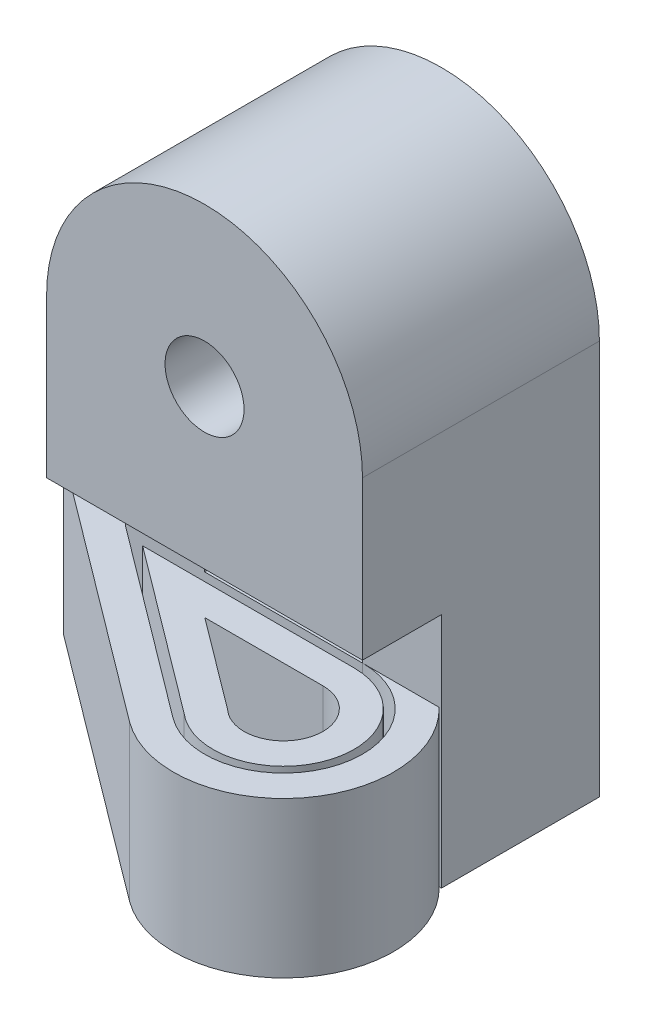
ISO-10303-21;
HEADER;
FILE_DESCRIPTION(('STEP AP214'),'2;1');
FILE_NAME('part.step','',(''),(''),'','','');
FILE_SCHEMA(('AUTOMOTIVE_DESIGN { 1 0 10303 214 1 1 1 1 }'));
ENDSEC;
DATA;
#1=APPLICATION_CONTEXT('core data for automotive mechanical design processes');
#2=APPLICATION_PROTOCOL_DEFINITION('international standard','automotive_design',2000,#1);
#3=PRODUCT_CONTEXT('',#1,'mechanical');
#4=PRODUCT('Part','Part','',(#3));
#5=PRODUCT_RELATED_PRODUCT_CATEGORY('part','',(#4));
#6=PRODUCT_DEFINITION_FORMATION('','',#4);
#7=PRODUCT_DEFINITION_CONTEXT('part definition',#1,'design');
#8=PRODUCT_DEFINITION('design','',#6,#7);
#9=PRODUCT_DEFINITION_SHAPE('','',#8);
#10=(LENGTH_UNIT() NAMED_UNIT(*) SI_UNIT(.MILLI.,.METRE.));
#11=(NAMED_UNIT(*) PLANE_ANGLE_UNIT() SI_UNIT($,.RADIAN.));
#12=(NAMED_UNIT(*) SI_UNIT($,.STERADIAN.) SOLID_ANGLE_UNIT());
#13=UNCERTAINTY_MEASURE_WITH_UNIT(LENGTH_MEASURE(1.E-05),#10,'distance_accuracy_value','');
#14=(GEOMETRIC_REPRESENTATION_CONTEXT(3) GLOBAL_UNCERTAINTY_ASSIGNED_CONTEXT((#13)) GLOBAL_UNIT_ASSIGNED_CONTEXT((#10,
#11,#12)) REPRESENTATION_CONTEXT('',''));
#15=CARTESIAN_POINT('',(0.,0.,0.));
#16=DIRECTION('',(0.,0.,1.));
#17=DIRECTION('',(1.,0.,0.));
#18=AXIS2_PLACEMENT_3D('',#15,#16,#17);
#19=CARTESIAN_POINT('',(76.2,50.,76.2));
#20=DIRECTION('',(0.,-1.,0.));
#21=DIRECTION('',(1.,0.,0.));
#22=AXIS2_PLACEMENT_3D('',#19,#20,#21);
#23=PLANE('',#22);
#24=DIRECTION('',(-1.,0.,0.));
#25=VECTOR('',#24,1.);
#26=CARTESIAN_POINT('',(0.,50.,53.5));
#27=LINE('',#26,#25);
#28=CARTESIAN_POINT('',(76.2,50.,53.5));
#29=VERTEX_POINT('',#28);
#30=CARTESIAN_POINT('',(8.19548632092121,50.,53.5));
#31=VERTEX_POINT('',#30);
#32=EDGE_CURVE('E262',#29,#31,#27,.T.);
#33=ORIENTED_EDGE('',*,*,#32,.T.);
#34=DIRECTION('',(0.8,0.,0.6));
#35=VECTOR('',#34,1.);
#36=CARTESIAN_POINT('',(-22.7296249244684,50.,30.3061665659578));
#37=LINE('',#36,#35);
#38=CARTESIAN_POINT('',(61.3249683822276,50.,93.3471115459798));
#39=VERTEX_POINT('',#38);
#40=EDGE_CURVE('E265',#31,#39,#37,.T.);
#41=ORIENTED_EDGE('',*,*,#40,.T.);
#42=CARTESIAN_POINT('',(76.2,50.,76.2));
#43=DIRECTION('',(0.,-1.,0.));
#44=DIRECTION('',(0.,0.,-1.));
#45=AXIS2_PLACEMENT_3D('',#42,#43,#44);
#46=CIRCLE('',#45,22.7);
#47=EDGE_CURVE('E268',#29,#39,#46,.T.);
#48=ORIENTED_EDGE('',*,*,#47,.F.);
#49=EDGE_LOOP('',(#33,#41,#48));
#50=FACE_BOUND('',#49,.T.);
#51=DIRECTION('',(-1.,0.,0.));
#52=VECTOR('',#51,1.);
#53=CARTESIAN_POINT('',(0.,50.,63.5));
#54=LINE('',#53,#52);
#55=CARTESIAN_POINT('',(76.2,50.,63.5));
#56=VERTEX_POINT('',#55);
#57=CARTESIAN_POINT('',(38.1954863209212,50.,63.5));
#58=VERTEX_POINT('',#57);
#59=EDGE_CURVE('E236',#56,#58,#54,.T.);
#60=ORIENTED_EDGE('',*,*,#59,.F.);
#61=CARTESIAN_POINT('',(76.2,50.,76.2));
#62=DIRECTION('',(0.,-1.,0.));
#63=DIRECTION('',(1.,0.,0.));
#64=AXIS2_PLACEMENT_3D('',#61,#62,#63);
#65=CIRCLE('',#64,12.7);
#66=CARTESIAN_POINT('',(67.6504068830784,50.,85.5911904216179));
#67=VERTEX_POINT('',#66);
#68=EDGE_CURVE('E253',#56,#67,#65,.T.);
#69=ORIENTED_EDGE('',*,*,#68,.T.);
#70=DIRECTION('',(0.8,0.,0.6));
#71=VECTOR('',#70,1.);
#72=CARTESIAN_POINT('',(-16.7296249244684,50.,22.3061665659578));
#73=LINE('',#72,#71);
#74=EDGE_CURVE('E244',#58,#67,#73,.T.);
#75=ORIENTED_EDGE('',*,*,#74,.F.);
#76=EDGE_LOOP('',(#60,#69,#75));
#77=FACE_BOUND('',#76,.T.);
#78=ADVANCED_FACE('F183',(#50,#77),#23,.F.);
#79=CARTESIAN_POINT('',(76.2,0.,76.2));
#80=DIRECTION('',(0.,-1.,0.));
#81=DIRECTION('',(1.,0.,0.));
#82=AXIS2_PLACEMENT_3D('',#79,#80,#81);
#83=PLANE('',#82);
#84=DIRECTION('',(-1.,0.,0.));
#85=VECTOR('',#84,1.);
#86=CARTESIAN_POINT('',(0.,0.,53.5));
#87=LINE('',#86,#85);
#88=CARTESIAN_POINT('',(76.2,0.,53.5));
#89=VERTEX_POINT('',#88);
#90=CARTESIAN_POINT('',(8.19548632092122,0.,53.5));
#91=VERTEX_POINT('',#90);
#92=EDGE_CURVE('E251',#89,#91,#87,.T.);
#93=ORIENTED_EDGE('',*,*,#92,.F.);
#94=CARTESIAN_POINT('',(76.2,0.,76.2));
#95=DIRECTION('',(0.,-1.,0.));
#96=DIRECTION('',(0.,0.,-1.));
#97=AXIS2_PLACEMENT_3D('',#94,#95,#96);
#98=CIRCLE('',#97,22.7);
#99=CARTESIAN_POINT('',(61.3249683822276,0.,93.3471115459798));
#100=VERTEX_POINT('',#99);
#101=EDGE_CURVE('E266',#89,#100,#98,.T.);
#102=ORIENTED_EDGE('',*,*,#101,.T.);
#103=DIRECTION('',(0.8,0.,0.6));
#104=VECTOR('',#103,1.);
#105=CARTESIAN_POINT('',(-22.7296249244684,0.,30.3061665659578));
#106=LINE('',#105,#104);
#107=EDGE_CURVE('E274',#91,#100,#106,.T.);
#108=ORIENTED_EDGE('',*,*,#107,.F.);
#109=EDGE_LOOP('',(#93,#102,#108));
#110=FACE_BOUND('',#109,.T.);
#111=CARTESIAN_POINT('',(76.2,0.,76.2));
#112=DIRECTION('',(0.,-1.,0.));
#113=DIRECTION('',(1.,0.,0.));
#114=AXIS2_PLACEMENT_3D('',#111,#112,#113);
#115=CIRCLE('',#114,12.7);
#116=CARTESIAN_POINT('',(76.2,0.,63.5));
#117=VERTEX_POINT('',#116);
#118=CARTESIAN_POINT('',(67.6504068830784,0.,85.5911904216179));
#119=VERTEX_POINT('',#118);
#120=EDGE_CURVE('E245',#117,#119,#115,.T.);
#121=ORIENTED_EDGE('',*,*,#120,.F.);
#122=DIRECTION('',(-1.,0.,0.));
#123=VECTOR('',#122,1.);
#124=CARTESIAN_POINT('',(0.,0.,63.5));
#125=LINE('',#124,#123);
#126=CARTESIAN_POINT('',(38.1954863209212,0.,63.5));
#127=VERTEX_POINT('',#126);
#128=EDGE_CURVE('E206',#117,#127,#125,.T.);
#129=ORIENTED_EDGE('',*,*,#128,.T.);
#130=DIRECTION('',(0.8,0.,0.6));
#131=VECTOR('',#130,1.);
#132=CARTESIAN_POINT('',(-16.7296249244684,0.,22.3061665659578));
#133=LINE('',#132,#131);
#134=EDGE_CURVE('E250',#127,#119,#133,.T.);
#135=ORIENTED_EDGE('',*,*,#134,.T.);
#136=EDGE_LOOP('',(#121,#129,#135));
#137=FACE_BOUND('',#136,.T.);
#138=ADVANCED_FACE('F289',(#110,#137),#83,.T.);
#139=CARTESIAN_POINT('',(0.,50.,53.5));
#140=DIRECTION('',(0.,0.,1.));
#141=DIRECTION('',(1.,0.,0.));
#142=AXIS2_PLACEMENT_3D('',#139,#140,#141);
#143=PLANE('',#142);
#144=ORIENTED_EDGE('',*,*,#92,.T.);
#145=DIRECTION('',(0.,-1.,0.));
#146=VECTOR('',#145,1.);
#147=CARTESIAN_POINT('',(8.19548632092121,50.,53.5));
#148=LINE('',#147,#146);
#149=EDGE_CURVE('E13',#31,#91,#148,.T.);
#150=ORIENTED_EDGE('',*,*,#149,.F.);
#151=ORIENTED_EDGE('',*,*,#32,.F.);
#152=DIRECTION('',(0.,-1.,0.));
#153=VECTOR('',#152,1.);
#154=CARTESIAN_POINT('',(76.2,50.,53.5));
#155=LINE('',#154,#153);
#156=EDGE_CURVE('E271',#29,#89,#155,.T.);
#157=ORIENTED_EDGE('',*,*,#156,.T.);
#158=EDGE_LOOP('',(#144,#150,#151,#157));
#159=FACE_BOUND('',#158,.T.);
#160=ADVANCED_FACE('F185',(#159),#143,.F.);
#161=CARTESIAN_POINT('',(-22.7296249244684,50.,30.3061665659578));
#162=DIRECTION('',(0.6,0.,-0.8));
#163=DIRECTION('',(-0.8,0.,-0.6));
#164=AXIS2_PLACEMENT_3D('',#161,#162,#163);
#165=PLANE('',#164);
#166=ORIENTED_EDGE('',*,*,#107,.T.);
#167=DIRECTION('',(0.,-1.,0.));
#168=VECTOR('',#167,1.);
#169=CARTESIAN_POINT('',(61.3249683822276,50.,93.3471115459798));
#170=LINE('',#169,#168);
#171=EDGE_CURVE('E191',#39,#100,#170,.T.);
#172=ORIENTED_EDGE('',*,*,#171,.F.);
#173=ORIENTED_EDGE('',*,*,#40,.F.);
#174=ORIENTED_EDGE('',*,*,#149,.T.);
#175=EDGE_LOOP('',(#166,#172,#173,#174));
#176=FACE_BOUND('',#175,.T.);
#177=ADVANCED_FACE('F285',(#176),#165,.F.);
#178=CARTESIAN_POINT('',(76.2,50.,76.2));
#179=DIRECTION('',(0.,-1.,0.));
#180=DIRECTION('',(1.,0.,0.));
#181=AXIS2_PLACEMENT_3D('',#178,#179,#180);
#182=CYLINDRICAL_SURFACE('',#181,22.7);
#183=ORIENTED_EDGE('',*,*,#101,.F.);
#184=ORIENTED_EDGE('',*,*,#156,.F.);
#185=ORIENTED_EDGE('',*,*,#47,.T.);
#186=ORIENTED_EDGE('',*,*,#171,.T.);
#187=EDGE_LOOP('',(#183,#184,#185,#186));
#188=FACE_BOUND('',#187,.T.);
#189=ADVANCED_FACE('F282',(#188),#182,.T.);
#190=CARTESIAN_POINT('',(0.,50.,63.5));
#191=DIRECTION('',(0.,0.,1.));
#192=DIRECTION('',(1.,0.,0.));
#193=AXIS2_PLACEMENT_3D('',#190,#191,#192);
#194=PLANE('',#193);
#195=ORIENTED_EDGE('',*,*,#128,.F.);
#196=DIRECTION('',(0.,-1.,0.));
#197=VECTOR('',#196,1.);
#198=CARTESIAN_POINT('',(76.2,50.,63.5));
#199=LINE('',#198,#197);
#200=EDGE_CURVE('E240',#56,#117,#199,.T.);
#201=ORIENTED_EDGE('',*,*,#200,.F.);
#202=ORIENTED_EDGE('',*,*,#59,.T.);
#203=DIRECTION('',(0.,-1.,0.));
#204=VECTOR('',#203,1.);
#205=CARTESIAN_POINT('',(38.1954863209212,50.,63.5));
#206=LINE('',#205,#204);
#207=EDGE_CURVE('E239',#58,#127,#206,.T.);
#208=ORIENTED_EDGE('',*,*,#207,.T.);
#209=EDGE_LOOP('',(#195,#201,#202,#208));
#210=FACE_BOUND('',#209,.T.);
#211=ADVANCED_FACE('F238',(#210),#194,.T.);
#212=CARTESIAN_POINT('',(-16.7296249244684,50.,22.3061665659578));
#213=DIRECTION('',(0.6,0.,-0.8));
#214=DIRECTION('',(-0.8,0.,-0.6));
#215=AXIS2_PLACEMENT_3D('',#212,#213,#214);
#216=PLANE('',#215);
#217=ORIENTED_EDGE('',*,*,#134,.F.);
#218=ORIENTED_EDGE('',*,*,#207,.F.);
#219=ORIENTED_EDGE('',*,*,#74,.T.);
#220=DIRECTION('',(0.,-1.,0.));
#221=VECTOR('',#220,1.);
#222=CARTESIAN_POINT('',(67.6504068830784,50.,85.5911904216179));
#223=LINE('',#222,#221);
#224=EDGE_CURVE('E198',#67,#119,#223,.T.);
#225=ORIENTED_EDGE('',*,*,#224,.T.);
#226=EDGE_LOOP('',(#217,#218,#219,#225));
#227=FACE_BOUND('',#226,.T.);
#228=ADVANCED_FACE('F248',(#227),#216,.T.);
#229=CARTESIAN_POINT('',(76.2,50.,76.2));
#230=DIRECTION('',(0.,-1.,0.));
#231=DIRECTION('',(1.,0.,0.));
#232=AXIS2_PLACEMENT_3D('',#229,#230,#231);
#233=CYLINDRICAL_SURFACE('',#232,12.7);
#234=ORIENTED_EDGE('',*,*,#120,.T.);
#235=ORIENTED_EDGE('',*,*,#224,.F.);
#236=ORIENTED_EDGE('',*,*,#68,.F.);
#237=ORIENTED_EDGE('',*,*,#200,.T.);
#238=EDGE_LOOP('',(#234,#235,#236,#237));
#239=FACE_BOUND('',#238,.T.);
#240=ADVANCED_FACE('F344',(#239),#233,.F.);
#241=CLOSED_SHELL('',(#78,#138,#160,#177,#189,#211,#228,#240));
#242=MANIFOLD_SOLID_BREP('B2',#241);
#243=CARTESIAN_POINT('',(0.,0.,50.8));
#244=DIRECTION('',(-1.,0.,0.));
#245=DIRECTION('',(0.,0.,1.));
#246=AXIS2_PLACEMENT_3D('',#243,#244,#245);
#247=PLANE('',#246);
#248=DIRECTION('',(0.,1.,0.));
#249=VECTOR('',#248,1.);
#250=CARTESIAN_POINT('',(0.,0.,40.8));
#251=LINE('',#250,#249);
#252=CARTESIAN_POINT('',(0.,0.,40.8));
#253=VERTEX_POINT('',#252);
#254=CARTESIAN_POINT('',(0.,50.,40.8));
#255=VERTEX_POINT('',#254);
#256=EDGE_CURVE('E377',#253,#255,#251,.T.);
#257=ORIENTED_EDGE('',*,*,#256,.T.);
#258=DIRECTION('',(0.,0.,1.));
#259=VECTOR('',#258,1.);
#260=CARTESIAN_POINT('',(0.,50.,50.8));
#261=LINE('',#260,#259);
#262=CARTESIAN_POINT('',(0.,50.,50.8));
#263=VERTEX_POINT('',#262);
#264=EDGE_CURVE('E497',#255,#263,#261,.T.);
#265=ORIENTED_EDGE('',*,*,#264,.T.);
#266=DIRECTION('',(0.,1.,0.));
#267=VECTOR('',#266,1.);
#268=CARTESIAN_POINT('',(0.,0.,50.8));
#269=LINE('',#268,#267);
#270=CARTESIAN_POINT('',(0.,76.2,50.8));
#271=VERTEX_POINT('',#270);
#272=EDGE_CURVE('E485',#263,#271,#269,.T.);
#273=ORIENTED_EDGE('',*,*,#272,.T.);
#274=DIRECTION('',(0.,0.,-1.));
#275=VECTOR('',#274,1.);
#276=CARTESIAN_POINT('',(0.,76.2,76.2));
#277=LINE('',#276,#275);
#278=CARTESIAN_POINT('',(0.,76.2,76.2));
#279=VERTEX_POINT('',#278);
#280=EDGE_CURVE('E612',#279,#271,#277,.T.);
#281=ORIENTED_EDGE('',*,*,#280,.F.);
#282=DIRECTION('',(0.,-1.,0.));
#283=VECTOR('',#282,1.);
#284=CARTESIAN_POINT('',(0.,127.,76.2));
#285=LINE('',#284,#283);
#286=CARTESIAN_POINT('',(0.,127.,76.2));
#287=VERTEX_POINT('',#286);
#288=EDGE_CURVE('E596',#287,#279,#285,.T.);
#289=ORIENTED_EDGE('',*,*,#288,.F.);
#290=DIRECTION('',(0.,0.,-1.));
#291=VECTOR('',#290,1.);
#292=CARTESIAN_POINT('',(0.,127.,50.8));
#293=LINE('',#292,#291);
#294=CARTESIAN_POINT('',(0.,127.,0.));
#295=VERTEX_POINT('',#294);
#296=EDGE_CURVE('E677',#287,#295,#293,.T.);
#297=ORIENTED_EDGE('',*,*,#296,.T.);
#298=DIRECTION('',(0.,1.,0.));
#299=VECTOR('',#298,1.);
#300=CARTESIAN_POINT('',(0.,0.,0.));
#301=LINE('',#300,#299);
#302=CARTESIAN_POINT('',(0.,0.,0.));
#303=VERTEX_POINT('',#302);
#304=EDGE_CURVE('E639',#303,#295,#301,.T.);
#305=ORIENTED_EDGE('',*,*,#304,.F.);
#306=DIRECTION('',(0.,0.,-1.));
#307=VECTOR('',#306,1.);
#308=CARTESIAN_POINT('',(0.,0.,50.8));
#309=LINE('',#308,#307);
#310=EDGE_CURVE('E382',#253,#303,#309,.T.);
#311=ORIENTED_EDGE('',*,*,#310,.F.);
#312=EDGE_LOOP('',(#257,#265,#273,#281,#289,#297,#305,#311));
#313=FACE_BOUND('',#312,.T.);
#314=ADVANCED_FACE('F361',(#313),#247,.T.);
#315=CARTESIAN_POINT('',(25.4,0.,50.8));
#316=DIRECTION('',(-1.,0.,0.));
#317=DIRECTION('',(0.,-1.,0.));
#318=AXIS2_PLACEMENT_3D('',#315,#316,#317);
#319=PLANE('',#318);
#320=DIRECTION('',(0.,0.,1.));
#321=VECTOR('',#320,1.);
#322=CARTESIAN_POINT('',(25.4,50.,50.8));
#323=LINE('',#322,#321);
#324=CARTESIAN_POINT('',(25.4,50.,40.8));
#325=VERTEX_POINT('',#324);
#326=CARTESIAN_POINT('',(25.4,50.,50.8));
#327=VERTEX_POINT('',#326);
#328=EDGE_CURVE('E503',#325,#327,#323,.T.);
#329=ORIENTED_EDGE('',*,*,#328,.F.);
#330=DIRECTION('',(0.,1.,0.));
#331=VECTOR('',#330,1.);
#332=CARTESIAN_POINT('',(25.4,0.,40.8));
#333=LINE('',#332,#331);
#334=CARTESIAN_POINT('',(25.4,0.,40.8));
#335=VERTEX_POINT('',#334);
#336=EDGE_CURVE('E502',#335,#325,#333,.T.);
#337=ORIENTED_EDGE('',*,*,#336,.F.);
#338=DIRECTION('',(0.,0.,-1.));
#339=VECTOR('',#338,1.);
#340=CARTESIAN_POINT('',(25.4,0.,50.8));
#341=LINE('',#340,#339);
#342=CARTESIAN_POINT('',(25.4,0.,0.));
#343=VERTEX_POINT('',#342);
#344=EDGE_CURVE('E672',#335,#343,#341,.T.);
#345=ORIENTED_EDGE('',*,*,#344,.T.);
#346=DIRECTION('',(0.,1.,0.));
#347=VECTOR('',#346,1.);
#348=CARTESIAN_POINT('',(25.4,0.,0.));
#349=LINE('',#348,#347);
#350=CARTESIAN_POINT('',(25.4,50.8,0.));
#351=VERTEX_POINT('',#350);
#352=EDGE_CURVE('E647',#343,#351,#349,.T.);
#353=ORIENTED_EDGE('',*,*,#352,.T.);
#354=DIRECTION('',(0.,0.,-1.));
#355=VECTOR('',#354,1.);
#356=CARTESIAN_POINT('',(25.4,50.8,50.8));
#357=LINE('',#356,#355);
#358=CARTESIAN_POINT('',(25.4,50.8,50.8));
#359=VERTEX_POINT('',#358);
#360=EDGE_CURVE('E668',#359,#351,#357,.T.);
#361=ORIENTED_EDGE('',*,*,#360,.F.);
#362=DIRECTION('',(0.,1.,0.));
#363=VECTOR('',#362,1.);
#364=CARTESIAN_POINT('',(25.4,0.,50.8));
#365=LINE('',#364,#363);
#366=EDGE_CURVE('E621',#327,#359,#365,.T.);
#367=ORIENTED_EDGE('',*,*,#366,.F.);
#368=EDGE_LOOP('',(#329,#337,#345,#353,#361,#367));
#369=FACE_BOUND('',#368,.T.);
#370=ADVANCED_FACE('F724',(#369),#319,.F.);
#371=CARTESIAN_POINT('',(76.2,0.,50.8));
#372=DIRECTION('',(-1.,0.,0.));
#373=DIRECTION('',(0.,0.,1.));
#374=AXIS2_PLACEMENT_3D('',#371,#372,#373);
#375=PLANE('',#374);
#376=DIRECTION('',(0.,-1.,0.));
#377=VECTOR('',#376,1.);
#378=CARTESIAN_POINT('',(76.2,50.,40.8));
#379=LINE('',#378,#377);
#380=CARTESIAN_POINT('',(76.2,50.,40.8));
#381=VERTEX_POINT('',#380);
#382=CARTESIAN_POINT('',(76.2,0.,40.8));
#383=VERTEX_POINT('',#382);
#384=EDGE_CURVE('E552',#381,#383,#379,.T.);
#385=ORIENTED_EDGE('',*,*,#384,.F.);
#386=DIRECTION('',(0.,0.,1.));
#387=VECTOR('',#386,1.);
#388=CARTESIAN_POINT('',(76.2,50.,50.8));
#389=LINE('',#388,#387);
#390=CARTESIAN_POINT('',(76.2,50.,50.8));
#391=VERTEX_POINT('',#390);
#392=EDGE_CURVE('E574',#381,#391,#389,.T.);
#393=ORIENTED_EDGE('',*,*,#392,.T.);
#394=DIRECTION('',(0.,1.,0.));
#395=VECTOR('',#394,1.);
#396=CARTESIAN_POINT('',(76.2,0.,50.8));
#397=LINE('',#396,#395);
#398=CARTESIAN_POINT('',(76.2,50.8,50.8));
#399=VERTEX_POINT('',#398);
#400=EDGE_CURVE('E629',#391,#399,#397,.T.);
#401=ORIENTED_EDGE('',*,*,#400,.T.);
#402=DIRECTION('',(0.,0.,-1.));
#403=VECTOR('',#402,1.);
#404=CARTESIAN_POINT('',(76.2,50.8,50.8));
#405=LINE('',#404,#403);
#406=CARTESIAN_POINT('',(76.2,50.8,0.));
#407=VERTEX_POINT('',#406);
#408=EDGE_CURVE('E665',#399,#407,#405,.T.);
#409=ORIENTED_EDGE('',*,*,#408,.T.);
#410=DIRECTION('',(0.,1.,0.));
#411=VECTOR('',#410,1.);
#412=CARTESIAN_POINT('',(76.2,0.,0.));
#413=LINE('',#412,#411);
#414=CARTESIAN_POINT('',(76.2,0.,0.));
#415=VERTEX_POINT('',#414);
#416=EDGE_CURVE('E654',#415,#407,#413,.T.);
#417=ORIENTED_EDGE('',*,*,#416,.F.);
#418=DIRECTION('',(0.,0.,-1.));
#419=VECTOR('',#418,1.);
#420=CARTESIAN_POINT('',(76.2,0.,50.8));
#421=LINE('',#420,#419);
#422=EDGE_CURVE('E662',#383,#415,#421,.T.);
#423=ORIENTED_EDGE('',*,*,#422,.F.);
#424=EDGE_LOOP('',(#385,#393,#401,#409,#417,#423));
#425=FACE_BOUND('',#424,.T.);
#426=ADVANCED_FACE('F730',(#425),#375,.T.);
#427=CARTESIAN_POINT('',(0.,0.,50.8));
#428=DIRECTION('',(0.,0.,1.));
#429=DIRECTION('',(1.,0.,0.));
#430=AXIS2_PLACEMENT_3D('',#427,#428,#429);
#431=PLANE('',#430);
#432=DIRECTION('',(1.,0.,0.));
#433=VECTOR('',#432,1.);
#434=CARTESIAN_POINT('',(0.,0.,50.8));
#435=LINE('',#434,#433);
#436=CARTESIAN_POINT('',(0.,0.,50.8));
#437=VERTEX_POINT('',#436);
#438=CARTESIAN_POINT('',(76.2,0.,50.8));
#439=VERTEX_POINT('',#438);
#440=EDGE_CURVE('E513',#437,#439,#435,.T.);
#441=ORIENTED_EDGE('',*,*,#440,.T.);
#442=DIRECTION('',(0.,-1.,0.));
#443=VECTOR('',#442,1.);
#444=CARTESIAN_POINT('',(76.2,50.,50.8));
#445=LINE('',#444,#443);
#446=EDGE_CURVE('E523',#391,#439,#445,.T.);
#447=ORIENTED_EDGE('',*,*,#446,.F.);
#448=DIRECTION('',(-1.,0.,0.));
#449=VECTOR('',#448,1.);
#450=CARTESIAN_POINT('',(0.,50.,50.8));
#451=LINE('',#450,#449);
#452=EDGE_CURVE('E519',#391,#327,#451,.T.);
#453=ORIENTED_EDGE('',*,*,#452,.T.);
#454=ORIENTED_EDGE('',*,*,#366,.T.);
#455=DIRECTION('',(1.,0.,0.));
#456=VECTOR('',#455,1.);
#457=CARTESIAN_POINT('',(0.,50.8,50.8));
#458=LINE('',#457,#456);
#459=EDGE_CURVE('E625',#359,#399,#458,.T.);
#460=ORIENTED_EDGE('',*,*,#459,.T.);
#461=ORIENTED_EDGE('',*,*,#400,.F.);
#462=DIRECTION('',(1.,0.,0.));
#463=VECTOR('',#462,1.);
#464=CARTESIAN_POINT('',(0.,50.,50.8));
#465=LINE('',#464,#463);
#466=CARTESIAN_POINT('',(100.857656011876,50.,50.8));
#467=VERTEX_POINT('',#466);
#468=EDGE_CURVE('E181',#391,#467,#465,.T.);
#469=ORIENTED_EDGE('',*,*,#468,.T.);
#470=DIRECTION('',(0.,-1.,0.));
#471=VECTOR('',#470,1.);
#472=CARTESIAN_POINT('',(100.857656011876,50.,50.8));
#473=LINE('',#472,#471);
#474=CARTESIAN_POINT('',(100.857656011876,0.,50.8));
#475=VERTEX_POINT('',#474);
#476=EDGE_CURVE('E370',#475,#467,#473,.F.);
#477=ORIENTED_EDGE('',*,*,#476,.F.);
#478=CARTESIAN_POINT('',(101.6,0.,50.8));
#479=VERTEX_POINT('',#478);
#480=EDGE_CURVE('E622',#475,#479,#435,.T.);
#481=ORIENTED_EDGE('',*,*,#480,.T.);
#482=DIRECTION('',(0.,1.,0.));
#483=VECTOR('',#482,1.);
#484=CARTESIAN_POINT('',(101.6,0.,50.8));
#485=LINE('',#484,#483);
#486=CARTESIAN_POINT('',(101.6,76.2,50.8));
#487=VERTEX_POINT('',#486);
#488=EDGE_CURVE('E495',#479,#487,#485,.T.);
#489=ORIENTED_EDGE('',*,*,#488,.T.);
#490=DIRECTION('',(1.,0.,0.));
#491=VECTOR('',#490,1.);
#492=CARTESIAN_POINT('',(0.,76.2,50.8));
#493=LINE('',#492,#491);
#494=EDGE_CURVE('E491',#271,#487,#493,.T.);
#495=ORIENTED_EDGE('',*,*,#494,.F.);
#496=ORIENTED_EDGE('',*,*,#272,.F.);
#497=EDGE_CURVE('E488',#437,#263,#269,.T.);
#498=ORIENTED_EDGE('',*,*,#497,.F.);
#499=EDGE_LOOP('',(#441,#447,#453,#454,#460,#461,#469,#477,#481,#489,#495,#496,#498));
#500=FACE_BOUND('',#499,.T.);
#501=ADVANCED_FACE('F486',(#500),#431,.T.);
#502=CARTESIAN_POINT('',(101.6,0.,50.8));
#503=DIRECTION('',(-1.,0.,0.));
#504=DIRECTION('',(0.,-1.,0.));
#505=AXIS2_PLACEMENT_3D('',#502,#503,#504);
#506=PLANE('',#505);
#507=DIRECTION('',(0.,1.,0.));
#508=VECTOR('',#507,1.);
#509=CARTESIAN_POINT('',(101.6,0.,0.));
#510=LINE('',#509,#508);
#511=CARTESIAN_POINT('',(101.6,0.,0.));
#512=VERTEX_POINT('',#511);
#513=CARTESIAN_POINT('',(101.6,127.,0.));
#514=VERTEX_POINT('',#513);
#515=EDGE_CURVE('E615',#512,#514,#510,.T.);
#516=ORIENTED_EDGE('',*,*,#515,.T.);
#517=DIRECTION('',(0.,0.,-1.));
#518=VECTOR('',#517,1.);
#519=CARTESIAN_POINT('',(101.6,127.,50.8));
#520=LINE('',#519,#518);
#521=CARTESIAN_POINT('',(101.6,127.,76.2));
#522=VERTEX_POINT('',#521);
#523=EDGE_CURVE('E680',#522,#514,#520,.T.);
#524=ORIENTED_EDGE('',*,*,#523,.F.);
#525=DIRECTION('',(0.,1.,0.));
#526=VECTOR('',#525,1.);
#527=CARTESIAN_POINT('',(101.6,127.,76.2));
#528=LINE('',#527,#526);
#529=CARTESIAN_POINT('',(101.6,76.2,76.2));
#530=VERTEX_POINT('',#529);
#531=EDGE_CURVE('E602',#530,#522,#528,.T.);
#532=ORIENTED_EDGE('',*,*,#531,.F.);
#533=DIRECTION('',(0.,0.,-1.));
#534=VECTOR('',#533,1.);
#535=CARTESIAN_POINT('',(101.6,76.2,76.2));
#536=LINE('',#535,#534);
#537=EDGE_CURVE('E606',#530,#487,#536,.T.);
#538=ORIENTED_EDGE('',*,*,#537,.T.);
#539=ORIENTED_EDGE('',*,*,#488,.F.);
#540=DIRECTION('',(0.,0.,-1.));
#541=VECTOR('',#540,1.);
#542=CARTESIAN_POINT('',(101.6,0.,50.8));
#543=LINE('',#542,#541);
#544=EDGE_CURVE('E658',#479,#512,#543,.T.);
#545=ORIENTED_EDGE('',*,*,#544,.T.);
#546=EDGE_LOOP('',(#516,#524,#532,#538,#539,#545));
#547=FACE_BOUND('',#546,.T.);
#548=ADVANCED_FACE('F363',(#547),#506,.F.);
#549=CARTESIAN_POINT('',(50.8,127.,50.8));
#550=DIRECTION('',(0.,0.,-1.));
#551=DIRECTION('',(-1.,0.,0.));
#552=AXIS2_PLACEMENT_3D('',#549,#550,#551);
#553=CYLINDRICAL_SURFACE('',#552,50.8);
#554=CARTESIAN_POINT('',(50.8,127.,0.));
#555=DIRECTION('',(0.,0.,1.));
#556=DIRECTION('',(1.,0.,0.));
#557=AXIS2_PLACEMENT_3D('',#554,#555,#556);
#558=CIRCLE('',#557,50.8);
#559=EDGE_CURVE('E635',#514,#295,#558,.T.);
#560=ORIENTED_EDGE('',*,*,#559,.T.);
#561=ORIENTED_EDGE('',*,*,#296,.F.);
#562=CARTESIAN_POINT('',(50.8,127.,76.2));
#563=DIRECTION('',(0.,0.,1.));
#564=DIRECTION('',(1.,0.,0.));
#565=AXIS2_PLACEMENT_3D('',#562,#563,#564);
#566=CIRCLE('',#565,50.8);
#567=EDGE_CURVE('E592',#522,#287,#566,.T.);
#568=ORIENTED_EDGE('',*,*,#567,.F.);
#569=ORIENTED_EDGE('',*,*,#523,.T.);
#570=EDGE_LOOP('',(#560,#561,#568,#569));
#571=FACE_BOUND('',#570,.T.);
#572=ADVANCED_FACE('F734',(#571),#553,.T.);
#573=CARTESIAN_POINT('',(0.,50.8,50.8));
#574=DIRECTION('',(0.,1.,0.));
#575=DIRECTION('',(0.,0.,1.));
#576=AXIS2_PLACEMENT_3D('',#573,#574,#575);
#577=PLANE('',#576);
#578=DIRECTION('',(1.,0.,0.));
#579=VECTOR('',#578,1.);
#580=CARTESIAN_POINT('',(0.,50.8,0.));
#581=LINE('',#580,#579);
#582=EDGE_CURVE('E650',#351,#407,#581,.T.);
#583=ORIENTED_EDGE('',*,*,#582,.T.);
#584=ORIENTED_EDGE('',*,*,#408,.F.);
#585=ORIENTED_EDGE('',*,*,#459,.F.);
#586=ORIENTED_EDGE('',*,*,#360,.T.);
#587=EDGE_LOOP('',(#583,#584,#585,#586));
#588=FACE_BOUND('',#587,.T.);
#589=ADVANCED_FACE('F736',(#588),#577,.F.);
#590=CARTESIAN_POINT('',(0.,0.,50.8));
#591=DIRECTION('',(0.,1.,0.));
#592=DIRECTION('',(-1.,0.,0.));
#593=AXIS2_PLACEMENT_3D('',#590,#591,#592);
#594=PLANE('',#593);
#595=DIRECTION('',(-1.,0.,0.));
#596=VECTOR('',#595,1.);
#597=CARTESIAN_POINT('',(0.,0.,40.8));
#598=LINE('',#597,#596);
#599=CARTESIAN_POINT('',(-30.,0.,40.8));
#600=VERTEX_POINT('',#599);
#601=EDGE_CURVE('E539',#253,#600,#598,.T.);
#602=ORIENTED_EDGE('',*,*,#601,.F.);
#603=ORIENTED_EDGE('',*,*,#310,.T.);
#604=DIRECTION('',(1.,0.,0.));
#605=VECTOR('',#604,1.);
#606=CARTESIAN_POINT('',(0.,0.,0.));
#607=LINE('',#606,#605);
#608=EDGE_CURVE('E643',#303,#343,#607,.T.);
#609=ORIENTED_EDGE('',*,*,#608,.T.);
#610=ORIENTED_EDGE('',*,*,#344,.F.);
#611=EDGE_CURVE('E553',#383,#335,#598,.T.);
#612=ORIENTED_EDGE('',*,*,#611,.F.);
#613=ORIENTED_EDGE('',*,*,#422,.T.);
#614=EDGE_CURVE('E617',#415,#512,#607,.T.);
#615=ORIENTED_EDGE('',*,*,#614,.T.);
#616=ORIENTED_EDGE('',*,*,#544,.F.);
#617=ORIENTED_EDGE('',*,*,#480,.F.);
#618=CARTESIAN_POINT('',(76.2,0.,76.2));
#619=DIRECTION('',(0.,-1.,0.));
#620=DIRECTION('',(0.,0.,-1.));
#621=AXIS2_PLACEMENT_3D('',#618,#619,#620);
#622=CIRCLE('',#621,35.4);
#623=CARTESIAN_POINT('',(54.96,0.,104.52));
#624=VERTEX_POINT('',#623);
#625=EDGE_CURVE('E560',#475,#624,#622,.T.);
#626=ORIENTED_EDGE('',*,*,#625,.T.);
#627=DIRECTION('',(0.8,0.,0.6));
#628=VECTOR('',#627,1.);
#629=CARTESIAN_POINT('',(-30.384,0.,40.512));
#630=LINE('',#629,#628);
#631=EDGE_CURVE('E556',#600,#624,#630,.T.);
#632=ORIENTED_EDGE('',*,*,#631,.F.);
#633=EDGE_LOOP('',(#602,#603,#609,#610,#612,#613,#615,#616,#617,#626,#632));
#634=FACE_BOUND('',#633,.T.);
#635=ORIENTED_EDGE('',*,*,#440,.F.);
#636=DIRECTION('',(0.8,0.,0.6));
#637=VECTOR('',#636,1.);
#638=CARTESIAN_POINT('',(-24.384,0.,32.512));
#639=LINE('',#638,#637);
#640=CARTESIAN_POINT('',(60.96,0.,96.52));
#641=VERTEX_POINT('',#640);
#642=EDGE_CURVE('E511',#437,#641,#639,.T.);
#643=ORIENTED_EDGE('',*,*,#642,.T.);
#644=CARTESIAN_POINT('',(76.2,0.,76.2));
#645=DIRECTION('',(0.,-1.,0.));
#646=DIRECTION('',(1.,0.,0.));
#647=AXIS2_PLACEMENT_3D('',#644,#645,#646);
#648=CIRCLE('',#647,25.4);
#649=EDGE_CURVE('E525',#439,#641,#648,.T.);
#650=ORIENTED_EDGE('',*,*,#649,.F.);
#651=EDGE_LOOP('',(#635,#643,#650));
#652=FACE_BOUND('',#651,.T.);
#653=ADVANCED_FACE('F699',(#634,#652),#594,.F.);
#654=CARTESIAN_POINT('',(0.,0.,0.));
#655=DIRECTION('',(0.,0.,1.));
#656=DIRECTION('',(1.,0.,0.));
#657=AXIS2_PLACEMENT_3D('',#654,#655,#656);
#658=PLANE('',#657);
#659=CARTESIAN_POINT('',(50.8,127.,0.));
#660=DIRECTION('',(0.,0.,1.));
#661=DIRECTION('',(1.,0.,0.));
#662=AXIS2_PLACEMENT_3D('',#659,#660,#661);
#663=CIRCLE('',#662,12.7);
#664=CARTESIAN_POINT('',(63.5,127.,0.));
#665=VERTEX_POINT('',#664);
#666=EDGE_CURVE('E585',#665,#665,#663,.T.);
#667=ORIENTED_EDGE('',*,*,#666,.T.);
#668=EDGE_LOOP('',(#667));
#669=FACE_BOUND('',#668,.T.);
#670=ORIENTED_EDGE('',*,*,#515,.F.);
#671=ORIENTED_EDGE('',*,*,#614,.F.);
#672=ORIENTED_EDGE('',*,*,#416,.T.);
#673=ORIENTED_EDGE('',*,*,#582,.F.);
#674=ORIENTED_EDGE('',*,*,#352,.F.);
#675=ORIENTED_EDGE('',*,*,#608,.F.);
#676=ORIENTED_EDGE('',*,*,#304,.T.);
#677=ORIENTED_EDGE('',*,*,#559,.F.);
#678=EDGE_LOOP('',(#670,#671,#672,#673,#674,#675,#676,#677));
#679=FACE_BOUND('',#678,.T.);
#680=ADVANCED_FACE('F750',(#669,#679),#658,.F.);
#681=CARTESIAN_POINT('',(0.,76.2,76.2));
#682=DIRECTION('',(0.,1.,0.));
#683=DIRECTION('',(0.,0.,1.));
#684=AXIS2_PLACEMENT_3D('',#681,#682,#683);
#685=PLANE('',#684);
#686=ORIENTED_EDGE('',*,*,#494,.T.);
#687=ORIENTED_EDGE('',*,*,#537,.F.);
#688=DIRECTION('',(1.,0.,0.));
#689=VECTOR('',#688,1.);
#690=CARTESIAN_POINT('',(0.,76.2,76.2));
#691=LINE('',#690,#689);
#692=EDGE_CURVE('E599',#279,#530,#691,.T.);
#693=ORIENTED_EDGE('',*,*,#692,.F.);
#694=ORIENTED_EDGE('',*,*,#280,.T.);
#695=EDGE_LOOP('',(#686,#687,#693,#694));
#696=FACE_BOUND('',#695,.T.);
#697=ADVANCED_FACE('F783',(#696),#685,.F.);
#698=CARTESIAN_POINT('',(50.8,127.,76.2));
#699=DIRECTION('',(0.,0.,1.));
#700=DIRECTION('',(1.,0.,0.));
#701=AXIS2_PLACEMENT_3D('',#698,#699,#700);
#702=PLANE('',#701);
#703=CARTESIAN_POINT('',(50.8,127.,76.2));
#704=DIRECTION('',(0.,0.,1.));
#705=DIRECTION('',(1.,0.,0.));
#706=AXIS2_PLACEMENT_3D('',#703,#704,#705);
#707=CIRCLE('',#706,12.7);
#708=CARTESIAN_POINT('',(63.5,127.,76.2));
#709=VERTEX_POINT('',#708);
#710=EDGE_CURVE('E584',#709,#709,#707,.T.);
#711=ORIENTED_EDGE('',*,*,#710,.F.);
#712=EDGE_LOOP('',(#711));
#713=FACE_BOUND('',#712,.T.);
#714=ORIENTED_EDGE('',*,*,#567,.T.);
#715=ORIENTED_EDGE('',*,*,#288,.T.);
#716=ORIENTED_EDGE('',*,*,#692,.T.);
#717=ORIENTED_EDGE('',*,*,#531,.T.);
#718=EDGE_LOOP('',(#714,#715,#716,#717));
#719=FACE_BOUND('',#718,.T.);
#720=ADVANCED_FACE('F754',(#713,#719),#702,.T.);
#721=CARTESIAN_POINT('',(50.8,127.,0.));
#722=DIRECTION('',(0.,0.,1.));
#723=DIRECTION('',(1.,0.,0.));
#724=AXIS2_PLACEMENT_3D('',#721,#722,#723);
#725=CYLINDRICAL_SURFACE('',#724,12.7);
#726=ORIENTED_EDGE('',*,*,#666,.F.);
#727=EDGE_LOOP('',(#726));
#728=FACE_BOUND('',#727,.T.);
#729=ORIENTED_EDGE('',*,*,#710,.T.);
#730=EDGE_LOOP('',(#729));
#731=FACE_BOUND('',#730,.T.);
#732=ADVANCED_FACE('F721',(#728,#731),#725,.F.);
#733=CARTESIAN_POINT('',(0.,50.,40.8));
#734=DIRECTION('',(0.,0.,1.));
#735=DIRECTION('',(1.,0.,0.));
#736=AXIS2_PLACEMENT_3D('',#733,#734,#735);
#737=PLANE('',#736);
#738=ORIENTED_EDGE('',*,*,#611,.T.);
#739=ORIENTED_EDGE('',*,*,#336,.T.);
#740=DIRECTION('',(-1.,0.,0.));
#741=VECTOR('',#740,1.);
#742=CARTESIAN_POINT('',(0.,50.,40.8));
#743=LINE('',#742,#741);
#744=EDGE_CURVE('E540',#381,#325,#743,.T.);
#745=ORIENTED_EDGE('',*,*,#744,.F.);
#746=ORIENTED_EDGE('',*,*,#384,.T.);
#747=EDGE_LOOP('',(#738,#739,#745,#746));
#748=FACE_BOUND('',#747,.T.);
#749=ADVANCED_FACE('F711',(#748),#737,.F.);
#750=CARTESIAN_POINT('',(76.2,50.,76.2));
#751=DIRECTION('',(0.,-1.,0.));
#752=DIRECTION('',(1.,0.,0.));
#753=AXIS2_PLACEMENT_3D('',#750,#751,#752);
#754=PLANE('',#753);
#755=ORIENTED_EDGE('',*,*,#744,.T.);
#756=ORIENTED_EDGE('',*,*,#328,.T.);
#757=ORIENTED_EDGE('',*,*,#452,.F.);
#758=ORIENTED_EDGE('',*,*,#392,.F.);
#759=EDGE_LOOP('',(#755,#756,#757,#758));
#760=FACE_BOUND('',#759,.T.);
#761=ADVANCED_FACE('F717',(#760),#754,.F.);
#762=ORIENTED_EDGE('',*,*,#264,.F.);
#763=CARTESIAN_POINT('',(-30.,50.,40.8));
#764=VERTEX_POINT('',#763);
#765=EDGE_CURVE('E545',#255,#764,#743,.T.);
#766=ORIENTED_EDGE('',*,*,#765,.T.);
#767=DIRECTION('',(0.8,0.,0.6));
#768=VECTOR('',#767,1.);
#769=CARTESIAN_POINT('',(-30.384,50.,40.512));
#770=LINE('',#769,#768);
#771=CARTESIAN_POINT('',(54.96,50.,104.52));
#772=VERTEX_POINT('',#771);
#773=EDGE_CURVE('E544',#764,#772,#770,.T.);
#774=ORIENTED_EDGE('',*,*,#773,.T.);
#775=CARTESIAN_POINT('',(76.2,50.,76.2));
#776=DIRECTION('',(0.,-1.,0.));
#777=DIRECTION('',(0.,0.,-1.));
#778=AXIS2_PLACEMENT_3D('',#775,#776,#777);
#779=CIRCLE('',#778,35.4);
#780=EDGE_CURVE('E549',#467,#772,#779,.T.);
#781=ORIENTED_EDGE('',*,*,#780,.F.);
#782=ORIENTED_EDGE('',*,*,#468,.F.);
#783=CARTESIAN_POINT('',(76.2,50.,76.2));
#784=DIRECTION('',(0.,-1.,0.));
#785=DIRECTION('',(1.,0.,0.));
#786=AXIS2_PLACEMENT_3D('',#783,#784,#785);
#787=CIRCLE('',#786,25.4);
#788=CARTESIAN_POINT('',(60.96,50.,96.52));
#789=VERTEX_POINT('',#788);
#790=EDGE_CURVE('E517',#391,#789,#787,.T.);
#791=ORIENTED_EDGE('',*,*,#790,.T.);
#792=DIRECTION('',(0.8,0.,0.6));
#793=VECTOR('',#792,1.);
#794=CARTESIAN_POINT('',(-24.384,50.,32.512));
#795=LINE('',#794,#793);
#796=EDGE_CURVE('E508',#263,#789,#795,.T.);
#797=ORIENTED_EDGE('',*,*,#796,.F.);
#798=EDGE_LOOP('',(#762,#766,#774,#781,#782,#791,#797));
#799=FACE_BOUND('',#798,.T.);
#800=ADVANCED_FACE('F514',(#799),#754,.F.);
#801=ORIENTED_EDGE('',*,*,#256,.F.);
#802=ORIENTED_EDGE('',*,*,#601,.T.);
#803=DIRECTION('',(0.,-1.,0.));
#804=VECTOR('',#803,1.);
#805=CARTESIAN_POINT('',(-30.,50.,40.8));
#806=LINE('',#805,#804);
#807=EDGE_CURVE('E570',#764,#600,#806,.T.);
#808=ORIENTED_EDGE('',*,*,#807,.F.);
#809=ORIENTED_EDGE('',*,*,#765,.F.);
#810=EDGE_LOOP('',(#801,#802,#808,#809));
#811=FACE_BOUND('',#810,.T.);
#812=ADVANCED_FACE('F708',(#811),#737,.F.);
#813=CARTESIAN_POINT('',(-30.384,50.,40.512));
#814=DIRECTION('',(0.6,0.,-0.8));
#815=DIRECTION('',(-0.8,0.,-0.6));
#816=AXIS2_PLACEMENT_3D('',#813,#814,#815);
#817=PLANE('',#816);
#818=ORIENTED_EDGE('',*,*,#631,.T.);
#819=DIRECTION('',(0.,-1.,0.));
#820=VECTOR('',#819,1.);
#821=CARTESIAN_POINT('',(54.96,50.,104.52));
#822=LINE('',#821,#820);
#823=EDGE_CURVE('E566',#772,#624,#822,.T.);
#824=ORIENTED_EDGE('',*,*,#823,.F.);
#825=ORIENTED_EDGE('',*,*,#773,.F.);
#826=ORIENTED_EDGE('',*,*,#807,.T.);
#827=EDGE_LOOP('',(#818,#824,#825,#826));
#828=FACE_BOUND('',#827,.T.);
#829=ADVANCED_FACE('F695',(#828),#817,.F.);
#830=CARTESIAN_POINT('',(76.2,50.,76.2));
#831=DIRECTION('',(0.,-1.,0.));
#832=DIRECTION('',(1.,0.,0.));
#833=AXIS2_PLACEMENT_3D('',#830,#831,#832);
#834=CYLINDRICAL_SURFACE('',#833,35.4);
#835=ORIENTED_EDGE('',*,*,#625,.F.);
#836=ORIENTED_EDGE('',*,*,#476,.T.);
#837=ORIENTED_EDGE('',*,*,#780,.T.);
#838=ORIENTED_EDGE('',*,*,#823,.T.);
#839=EDGE_LOOP('',(#835,#836,#837,#838));
#840=FACE_BOUND('',#839,.T.);
#841=ADVANCED_FACE('F688',(#840),#834,.T.);
#842=CARTESIAN_POINT('',(-24.384,50.,32.512));
#843=DIRECTION('',(0.6,0.,-0.8));
#844=DIRECTION('',(-0.8,0.,-0.6));
#845=AXIS2_PLACEMENT_3D('',#842,#843,#844);
#846=PLANE('',#845);
#847=ORIENTED_EDGE('',*,*,#642,.F.);
#848=ORIENTED_EDGE('',*,*,#497,.T.);
#849=ORIENTED_EDGE('',*,*,#796,.T.);
#850=DIRECTION('',(0.,-1.,0.));
#851=VECTOR('',#850,1.);
#852=CARTESIAN_POINT('',(60.96,50.,96.52));
#853=LINE('',#852,#851);
#854=EDGE_CURVE('E536',#789,#641,#853,.T.);
#855=ORIENTED_EDGE('',*,*,#854,.T.);
#856=EDGE_LOOP('',(#847,#848,#849,#855));
#857=FACE_BOUND('',#856,.T.);
#858=ADVANCED_FACE('F507',(#857),#846,.T.);
#859=CARTESIAN_POINT('',(76.2,50.,76.2));
#860=DIRECTION('',(0.,-1.,0.));
#861=DIRECTION('',(1.,0.,0.));
#862=AXIS2_PLACEMENT_3D('',#859,#860,#861);
#863=CYLINDRICAL_SURFACE('',#862,25.4);
#864=ORIENTED_EDGE('',*,*,#649,.T.);
#865=ORIENTED_EDGE('',*,*,#854,.F.);
#866=ORIENTED_EDGE('',*,*,#790,.F.);
#867=ORIENTED_EDGE('',*,*,#446,.T.);
#868=EDGE_LOOP('',(#864,#865,#866,#867));
#869=FACE_BOUND('',#868,.T.);
#870=ADVANCED_FACE('F776',(#869),#863,.F.);
#871=CLOSED_SHELL('',(#314,#370,#426,#501,#548,#572,#589,#653,#680,#697,#720,#732,#749,#761,
#800,#812,#829,#841,#858,#870));
#872=MANIFOLD_SOLID_BREP('B7',#871);
#873=ADVANCED_BREP_SHAPE_REPRESENTATION('',(#18,#242,#872),#14);
#874=SHAPE_DEFINITION_REPRESENTATION(#9,#873);
ENDSEC;
END-ISO-10303-21;
